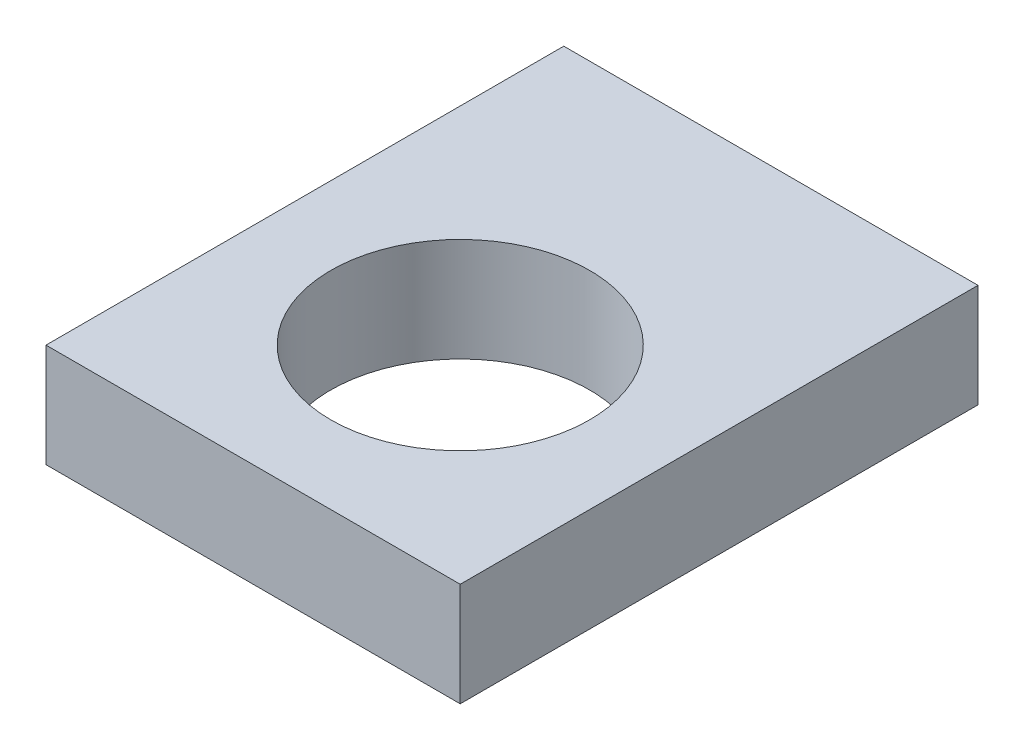
ISO-10303-21;
HEADER;
FILE_DESCRIPTION(('STEP AP214'),'2;1');
FILE_NAME('part.step','',(''),(''),'','','');
FILE_SCHEMA(('AUTOMOTIVE_DESIGN { 1 0 10303 214 1 1 1 1 }'));
ENDSEC;
DATA;
#1=APPLICATION_CONTEXT('core data for automotive mechanical design processes');
#2=APPLICATION_PROTOCOL_DEFINITION('international standard','automotive_design',2000,#1);
#3=PRODUCT_CONTEXT('',#1,'mechanical');
#4=PRODUCT('Part','Part','',(#3));
#5=PRODUCT_RELATED_PRODUCT_CATEGORY('part','',(#4));
#6=PRODUCT_DEFINITION_FORMATION('','',#4);
#7=PRODUCT_DEFINITION_CONTEXT('part definition',#1,'design');
#8=PRODUCT_DEFINITION('design','',#6,#7);
#9=PRODUCT_DEFINITION_SHAPE('','',#8);
#10=(LENGTH_UNIT() NAMED_UNIT(*) SI_UNIT(.MILLI.,.METRE.));
#11=(NAMED_UNIT(*) PLANE_ANGLE_UNIT() SI_UNIT($,.RADIAN.));
#12=(NAMED_UNIT(*) SI_UNIT($,.STERADIAN.) SOLID_ANGLE_UNIT());
#13=UNCERTAINTY_MEASURE_WITH_UNIT(LENGTH_MEASURE(1.E-05),#10,'distance_accuracy_value','');
#14=(GEOMETRIC_REPRESENTATION_CONTEXT(3) GLOBAL_UNCERTAINTY_ASSIGNED_CONTEXT((#13)) GLOBAL_UNIT_ASSIGNED_CONTEXT((#10,
#11,#12)) REPRESENTATION_CONTEXT('',''));
#15=CARTESIAN_POINT('',(0.,0.,0.));
#16=DIRECTION('',(0.,0.,1.));
#17=DIRECTION('',(1.,0.,0.));
#18=AXIS2_PLACEMENT_3D('',#15,#16,#17);
#19=CARTESIAN_POINT('',(-25.4,6.35,-38.1));
#20=DIRECTION('',(1.,0.,0.));
#21=DIRECTION('',(0.,0.,-1.));
#22=AXIS2_PLACEMENT_3D('',#19,#20,#21);
#23=PLANE('',#22);
#24=DIRECTION('',(0.,0.,1.));
#25=VECTOR('',#24,1.);
#26=CARTESIAN_POINT('',(-25.4,-6.35,-38.1));
#27=LINE('',#26,#25);
#28=CARTESIAN_POINT('',(-25.4,-6.35,-38.1));
#29=VERTEX_POINT('',#28);
#30=CARTESIAN_POINT('',(-25.4,-6.35,25.4));
#31=VERTEX_POINT('',#30);
#32=EDGE_CURVE('E107',#29,#31,#27,.T.);
#33=ORIENTED_EDGE('',*,*,#32,.T.);
#34=DIRECTION('',(0.,-1.,0.));
#35=VECTOR('',#34,1.);
#36=CARTESIAN_POINT('',(-25.4,6.35,25.4));
#37=LINE('',#36,#35);
#38=CARTESIAN_POINT('',(-25.4,6.35,25.4));
#39=VERTEX_POINT('',#38);
#40=EDGE_CURVE('E11',#39,#31,#37,.T.);
#41=ORIENTED_EDGE('',*,*,#40,.F.);
#42=DIRECTION('',(0.,0.,1.));
#43=VECTOR('',#42,1.);
#44=CARTESIAN_POINT('',(-25.4,6.35,-38.1));
#45=LINE('',#44,#43);
#46=CARTESIAN_POINT('',(-25.4,6.35,-38.1));
#47=VERTEX_POINT('',#46);
#48=EDGE_CURVE('E94',#47,#39,#45,.T.);
#49=ORIENTED_EDGE('',*,*,#48,.F.);
#50=DIRECTION('',(0.,-1.,0.));
#51=VECTOR('',#50,1.);
#52=CARTESIAN_POINT('',(-25.4,6.35,-38.1));
#53=LINE('',#52,#51);
#54=EDGE_CURVE('E103',#47,#29,#53,.T.);
#55=ORIENTED_EDGE('',*,*,#54,.T.);
#56=EDGE_LOOP('',(#33,#41,#49,#55));
#57=FACE_BOUND('',#56,.T.);
#58=ADVANCED_FACE('F40',(#57),#23,.F.);
#59=CARTESIAN_POINT('',(25.4,6.35,25.4));
#60=DIRECTION('',(0.,0.,-1.));
#61=DIRECTION('',(-1.,0.,0.));
#62=AXIS2_PLACEMENT_3D('',#59,#60,#61);
#63=PLANE('',#62);
#64=DIRECTION('',(1.,0.,0.));
#65=VECTOR('',#64,1.);
#66=CARTESIAN_POINT('',(25.4,-6.35,25.4));
#67=LINE('',#66,#65);
#68=CARTESIAN_POINT('',(25.4,-6.35,25.4));
#69=VERTEX_POINT('',#68);
#70=EDGE_CURVE('E99',#31,#69,#67,.T.);
#71=ORIENTED_EDGE('',*,*,#70,.T.);
#72=DIRECTION('',(0.,-1.,0.));
#73=VECTOR('',#72,1.);
#74=CARTESIAN_POINT('',(25.4,6.35,25.4));
#75=LINE('',#74,#73);
#76=CARTESIAN_POINT('',(25.4,6.35,25.4));
#77=VERTEX_POINT('',#76);
#78=EDGE_CURVE('E49',#77,#69,#75,.T.);
#79=ORIENTED_EDGE('',*,*,#78,.F.);
#80=DIRECTION('',(1.,0.,0.));
#81=VECTOR('',#80,1.);
#82=CARTESIAN_POINT('',(25.4,6.35,25.4));
#83=LINE('',#82,#81);
#84=EDGE_CURVE('E89',#39,#77,#83,.T.);
#85=ORIENTED_EDGE('',*,*,#84,.F.);
#86=ORIENTED_EDGE('',*,*,#40,.T.);
#87=EDGE_LOOP('',(#71,#79,#85,#86));
#88=FACE_BOUND('',#87,.T.);
#89=ADVANCED_FACE('F98',(#88),#63,.F.);
#90=CARTESIAN_POINT('',(25.4,6.35,-38.1));
#91=DIRECTION('',(-1.,0.,0.));
#92=DIRECTION('',(0.,0.,1.));
#93=AXIS2_PLACEMENT_3D('',#90,#91,#92);
#94=PLANE('',#93);
#95=DIRECTION('',(0.,0.,-1.));
#96=VECTOR('',#95,1.);
#97=CARTESIAN_POINT('',(25.4,-6.35,-38.1));
#98=LINE('',#97,#96);
#99=CARTESIAN_POINT('',(25.4,-6.35,-38.1));
#100=VERTEX_POINT('',#99);
#101=EDGE_CURVE('E75',#69,#100,#98,.T.);
#102=ORIENTED_EDGE('',*,*,#101,.T.);
#103=DIRECTION('',(0.,-1.,0.));
#104=VECTOR('',#103,1.);
#105=CARTESIAN_POINT('',(25.4,6.35,-38.1));
#106=LINE('',#105,#104);
#107=CARTESIAN_POINT('',(25.4,6.35,-38.1));
#108=VERTEX_POINT('',#107);
#109=EDGE_CURVE('E100',#108,#100,#106,.T.);
#110=ORIENTED_EDGE('',*,*,#109,.F.);
#111=DIRECTION('',(0.,0.,-1.));
#112=VECTOR('',#111,1.);
#113=CARTESIAN_POINT('',(25.4,6.35,-38.1));
#114=LINE('',#113,#112);
#115=EDGE_CURVE('E92',#77,#108,#114,.T.);
#116=ORIENTED_EDGE('',*,*,#115,.F.);
#117=ORIENTED_EDGE('',*,*,#78,.T.);
#118=EDGE_LOOP('',(#102,#110,#116,#117));
#119=FACE_BOUND('',#118,.T.);
#120=ADVANCED_FACE('F101',(#119),#94,.F.);
#121=CARTESIAN_POINT('',(25.4,6.35,-38.1));
#122=DIRECTION('',(0.,0.,1.));
#123=DIRECTION('',(1.,0.,0.));
#124=AXIS2_PLACEMENT_3D('',#121,#122,#123);
#125=PLANE('',#124);
#126=CARTESIAN_POINT('',(-15.875,0.,-38.1));
#127=DIRECTION('',(0.,0.,-1.));
#128=DIRECTION('',(-1.,0.,0.));
#129=AXIS2_PLACEMENT_3D('',#126,#127,#128);
#130=CIRCLE('',#129,3.175);
#131=CARTESIAN_POINT('',(-19.05,0.,-38.1));
#132=VERTEX_POINT('',#131);
#133=EDGE_CURVE('E138',#132,#132,#130,.T.);
#134=ORIENTED_EDGE('',*,*,#133,.F.);
#135=EDGE_LOOP('',(#134));
#136=FACE_BOUND('',#135,.T.);
#137=CARTESIAN_POINT('',(15.875,0.,-38.1));
#138=DIRECTION('',(0.,0.,-1.));
#139=DIRECTION('',(-1.,0.,0.));
#140=AXIS2_PLACEMENT_3D('',#137,#138,#139);
#141=CIRCLE('',#140,3.175);
#142=CARTESIAN_POINT('',(12.7,0.,-38.1));
#143=VERTEX_POINT('',#142);
#144=EDGE_CURVE('E132',#143,#143,#141,.T.);
#145=ORIENTED_EDGE('',*,*,#144,.F.);
#146=EDGE_LOOP('',(#145));
#147=FACE_BOUND('',#146,.T.);
#148=DIRECTION('',(-1.,0.,0.));
#149=VECTOR('',#148,1.);
#150=CARTESIAN_POINT('',(25.4,-6.35,-38.1));
#151=LINE('',#150,#149);
#152=EDGE_CURVE('E81',#100,#29,#151,.T.);
#153=ORIENTED_EDGE('',*,*,#152,.T.);
#154=ORIENTED_EDGE('',*,*,#54,.F.);
#155=DIRECTION('',(-1.,0.,0.));
#156=VECTOR('',#155,1.);
#157=CARTESIAN_POINT('',(25.4,6.35,-38.1));
#158=LINE('',#157,#156);
#159=EDGE_CURVE('E57',#108,#47,#158,.T.);
#160=ORIENTED_EDGE('',*,*,#159,.F.);
#161=ORIENTED_EDGE('',*,*,#109,.T.);
#162=EDGE_LOOP('',(#153,#154,#160,#161));
#163=FACE_BOUND('',#162,.T.);
#164=ADVANCED_FACE('F117',(#136,#147,#163),#125,.F.);
#165=CARTESIAN_POINT('',(-25.4,6.35,25.4));
#166=DIRECTION('',(0.,-1.,0.));
#167=DIRECTION('',(0.,0.,-1.));
#168=AXIS2_PLACEMENT_3D('',#165,#166,#167);
#169=PLANE('',#168);
#170=CARTESIAN_POINT('',(0.,6.35,0.));
#171=DIRECTION('',(0.,1.,0.));
#172=DIRECTION('',(0.,0.,1.));
#173=AXIS2_PLACEMENT_3D('',#170,#171,#172);
#174=CIRCLE('',#173,15.875);
#175=CARTESIAN_POINT('',(0.,6.35,15.875));
#176=VERTEX_POINT('',#175);
#177=EDGE_CURVE('E125',#176,#176,#174,.T.);
#178=ORIENTED_EDGE('',*,*,#177,.F.);
#179=EDGE_LOOP('',(#178));
#180=FACE_BOUND('',#179,.T.);
#181=ORIENTED_EDGE('',*,*,#48,.T.);
#182=ORIENTED_EDGE('',*,*,#84,.T.);
#183=ORIENTED_EDGE('',*,*,#115,.T.);
#184=ORIENTED_EDGE('',*,*,#159,.T.);
#185=EDGE_LOOP('',(#181,#182,#183,#184));
#186=FACE_BOUND('',#185,.T.);
#187=ADVANCED_FACE('F90',(#180,#186),#169,.F.);
#188=CARTESIAN_POINT('',(-25.4,-6.35,25.4));
#189=DIRECTION('',(0.,-1.,0.));
#190=DIRECTION('',(0.,0.,-1.));
#191=AXIS2_PLACEMENT_3D('',#188,#189,#190);
#192=PLANE('',#191);
#193=CARTESIAN_POINT('',(0.,-6.35,0.));
#194=DIRECTION('',(0.,1.,0.));
#195=DIRECTION('',(0.,0.,1.));
#196=AXIS2_PLACEMENT_3D('',#193,#194,#195);
#197=CIRCLE('',#196,15.875);
#198=CARTESIAN_POINT('',(0.,-6.35,15.875));
#199=VERTEX_POINT('',#198);
#200=EDGE_CURVE('E111',#199,#199,#197,.T.);
#201=ORIENTED_EDGE('',*,*,#200,.T.);
#202=EDGE_LOOP('',(#201));
#203=FACE_BOUND('',#202,.T.);
#204=ORIENTED_EDGE('',*,*,#32,.F.);
#205=ORIENTED_EDGE('',*,*,#152,.F.);
#206=ORIENTED_EDGE('',*,*,#101,.F.);
#207=ORIENTED_EDGE('',*,*,#70,.F.);
#208=EDGE_LOOP('',(#204,#205,#206,#207));
#209=FACE_BOUND('',#208,.T.);
#210=ADVANCED_FACE('F120',(#203,#209),#192,.T.);
#211=CARTESIAN_POINT('',(0.,-6.35,0.));
#212=DIRECTION('',(0.,1.,0.));
#213=DIRECTION('',(0.,0.,1.));
#214=AXIS2_PLACEMENT_3D('',#211,#212,#213);
#215=CYLINDRICAL_SURFACE('',#214,15.875);
#216=ORIENTED_EDGE('',*,*,#200,.F.);
#217=EDGE_LOOP('',(#216));
#218=FACE_BOUND('',#217,.T.);
#219=ORIENTED_EDGE('',*,*,#177,.T.);
#220=EDGE_LOOP('',(#219));
#221=FACE_BOUND('',#220,.T.);
#222=ADVANCED_FACE('F160',(#218,#221),#215,.F.);
#223=CARTESIAN_POINT('',(15.875,0.,-25.4));
#224=DIRECTION('',(0.,0.,-1.));
#225=DIRECTION('',(-1.,0.,0.));
#226=AXIS2_PLACEMENT_3D('',#223,#224,#225);
#227=CYLINDRICAL_SURFACE('',#226,3.175);
#228=CARTESIAN_POINT('',(15.875,0.,-25.4));
#229=DIRECTION('',(0.,0.,-1.));
#230=DIRECTION('',(-1.,0.,0.));
#231=AXIS2_PLACEMENT_3D('',#228,#229,#230);
#232=CIRCLE('',#231,3.175);
#233=CARTESIAN_POINT('',(12.7,0.,-25.4));
#234=VERTEX_POINT('',#233);
#235=EDGE_CURVE('E129',#234,#234,#232,.T.);
#236=ORIENTED_EDGE('',*,*,#235,.F.);
#237=EDGE_LOOP('',(#236));
#238=FACE_BOUND('',#237,.T.);
#239=ORIENTED_EDGE('',*,*,#144,.T.);
#240=EDGE_LOOP('',(#239));
#241=FACE_BOUND('',#240,.T.);
#242=ADVANCED_FACE('F158',(#238,#241),#227,.F.);
#243=CARTESIAN_POINT('',(15.875,0.,-25.4));
#244=DIRECTION('',(0.,0.,-1.));
#245=DIRECTION('',(-1.,0.,0.));
#246=AXIS2_PLACEMENT_3D('',#243,#244,#245);
#247=PLANE('',#246);
#248=ORIENTED_EDGE('',*,*,#235,.T.);
#249=EDGE_LOOP('',(#248));
#250=FACE_BOUND('',#249,.T.);
#251=ADVANCED_FACE('F149',(#250),#247,.T.);
#252=CARTESIAN_POINT('',(-15.875,0.,-25.4));
#253=DIRECTION('',(0.,0.,-1.));
#254=DIRECTION('',(-1.,0.,0.));
#255=AXIS2_PLACEMENT_3D('',#252,#253,#254);
#256=CYLINDRICAL_SURFACE('',#255,3.175);
#257=CARTESIAN_POINT('',(-15.875,0.,-25.4));
#258=DIRECTION('',(0.,0.,-1.));
#259=DIRECTION('',(-1.,0.,0.));
#260=AXIS2_PLACEMENT_3D('',#257,#258,#259);
#261=CIRCLE('',#260,3.175);
#262=CARTESIAN_POINT('',(-19.05,0.,-25.4));
#263=VERTEX_POINT('',#262);
#264=EDGE_CURVE('E135',#263,#263,#261,.T.);
#265=ORIENTED_EDGE('',*,*,#264,.F.);
#266=EDGE_LOOP('',(#265));
#267=FACE_BOUND('',#266,.T.);
#268=ORIENTED_EDGE('',*,*,#133,.T.);
#269=EDGE_LOOP('',(#268));
#270=FACE_BOUND('',#269,.T.);
#271=ADVANCED_FACE('F146',(#267,#270),#256,.F.);
#272=CARTESIAN_POINT('',(-15.875,0.,-25.4));
#273=DIRECTION('',(0.,0.,-1.));
#274=DIRECTION('',(-1.,0.,0.));
#275=AXIS2_PLACEMENT_3D('',#272,#273,#274);
#276=PLANE('',#275);
#277=ORIENTED_EDGE('',*,*,#264,.T.);
#278=EDGE_LOOP('',(#277));
#279=FACE_BOUND('',#278,.T.);
#280=ADVANCED_FACE('F144',(#279),#276,.T.);
#281=CLOSED_SHELL('',(#58,#89,#120,#164,#187,#210,#222,#242,#251,#271,#280));
#282=MANIFOLD_SOLID_BREP('B2',#281);
#283=ADVANCED_BREP_SHAPE_REPRESENTATION('',(#18,#282),#14);
#284=SHAPE_DEFINITION_REPRESENTATION(#9,#283);
ENDSEC;
END-ISO-10303-21;
